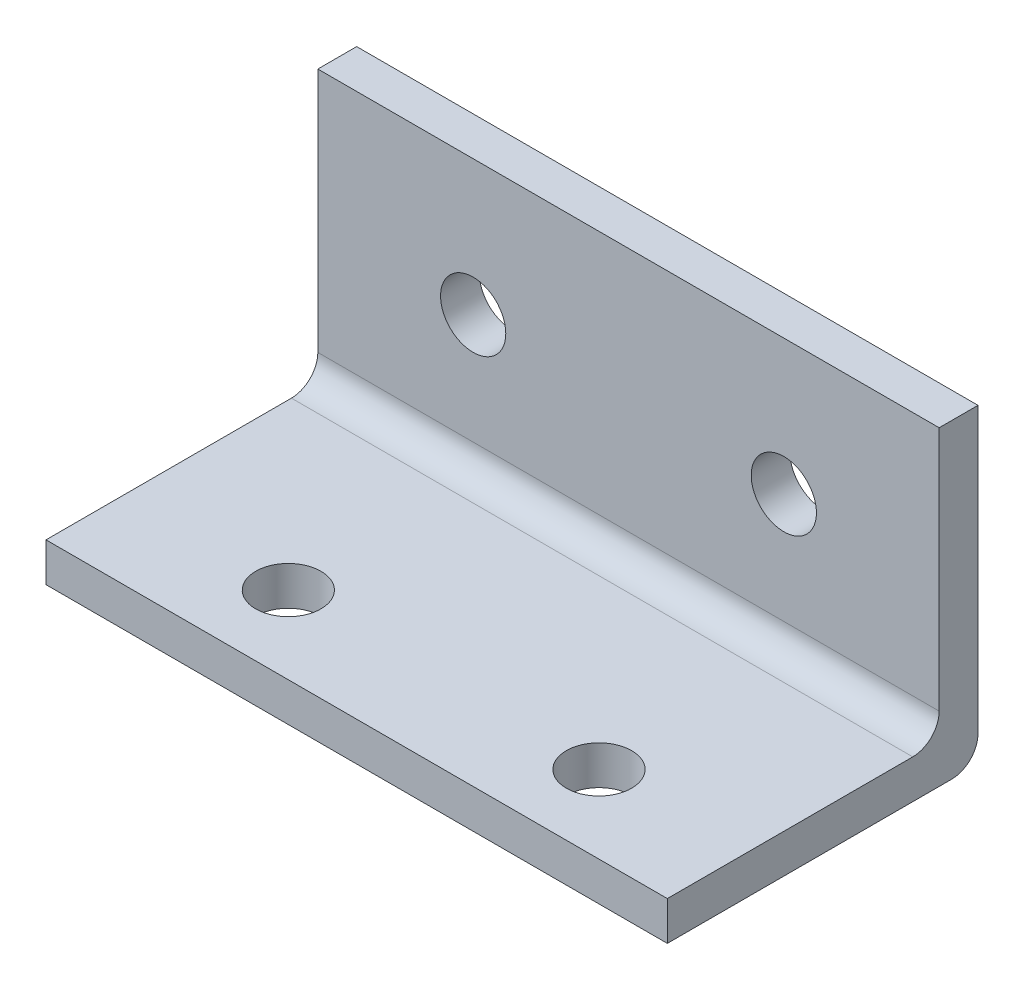
ISO-10303-21;
HEADER;
FILE_DESCRIPTION(('STEP AP214'),'2;1');
FILE_NAME('part.step','',(''),(''),'','','');
FILE_SCHEMA(('AUTOMOTIVE_DESIGN { 1 0 10303 214 1 1 1 1 }'));
ENDSEC;
DATA;
#1=APPLICATION_CONTEXT('core data for automotive mechanical design processes');
#2=APPLICATION_PROTOCOL_DEFINITION('international standard','automotive_design',2000,#1);
#3=PRODUCT_CONTEXT('',#1,'mechanical');
#4=PRODUCT('Part','Part','',(#3));
#5=PRODUCT_RELATED_PRODUCT_CATEGORY('part','',(#4));
#6=PRODUCT_DEFINITION_FORMATION('','',#4);
#7=PRODUCT_DEFINITION_CONTEXT('part definition',#1,'design');
#8=PRODUCT_DEFINITION('design','',#6,#7);
#9=PRODUCT_DEFINITION_SHAPE('','',#8);
#10=(LENGTH_UNIT() NAMED_UNIT(*) SI_UNIT(.MILLI.,.METRE.));
#11=(NAMED_UNIT(*) PLANE_ANGLE_UNIT() SI_UNIT($,.RADIAN.));
#12=(NAMED_UNIT(*) SI_UNIT($,.STERADIAN.) SOLID_ANGLE_UNIT());
#13=UNCERTAINTY_MEASURE_WITH_UNIT(LENGTH_MEASURE(1.E-05),#10,'distance_accuracy_value','');
#14=(GEOMETRIC_REPRESENTATION_CONTEXT(3) GLOBAL_UNCERTAINTY_ASSIGNED_CONTEXT((#13)) GLOBAL_UNIT_ASSIGNED_CONTEXT((#10,
#11,#12)) REPRESENTATION_CONTEXT('',''));
#15=CARTESIAN_POINT('',(0.,0.,0.));
#16=DIRECTION('',(0.,0.,1.));
#17=DIRECTION('',(1.,0.,0.));
#18=AXIS2_PLACEMENT_3D('',#15,#16,#17);
#19=CARTESIAN_POINT('',(50.8,0.,0.));
#20=DIRECTION('',(0.,1.,0.));
#21=DIRECTION('',(0.,0.,1.));
#22=AXIS2_PLACEMENT_3D('',#19,#20,#21);
#23=PLANE('',#22);
#24=CARTESIAN_POINT('',(13.462,0.,19.05));
#25=DIRECTION('',(0.,1.,0.));
#26=DIRECTION('',(0.,0.,1.));
#27=AXIS2_PLACEMENT_3D('',#24,#25,#26);
#28=CIRCLE('',#27,2.667);
#29=CARTESIAN_POINT('',(13.462,0.,21.717));
#30=VERTEX_POINT('',#29);
#31=EDGE_CURVE('E148',#30,#30,#28,.F.);
#32=ORIENTED_EDGE('',*,*,#31,.F.);
#33=EDGE_LOOP('',(#32));
#34=FACE_BOUND('',#33,.T.);
#35=CARTESIAN_POINT('',(38.862,0.,19.05));
#36=DIRECTION('',(0.,1.,0.));
#37=DIRECTION('',(0.,0.,1.));
#38=AXIS2_PLACEMENT_3D('',#35,#36,#37);
#39=CIRCLE('',#38,2.667);
#40=CARTESIAN_POINT('',(38.862,0.,21.717));
#41=VERTEX_POINT('',#40);
#42=EDGE_CURVE('E209',#41,#41,#39,.F.);
#43=ORIENTED_EDGE('',*,*,#42,.F.);
#44=EDGE_LOOP('',(#43));
#45=FACE_BOUND('',#44,.T.);
#46=DIRECTION('',(0.,0.,-1.));
#47=VECTOR('',#46,1.);
#48=CARTESIAN_POINT('',(0.,0.,0.));
#49=LINE('',#48,#47);
#50=CARTESIAN_POINT('',(0.,0.,25.4));
#51=VERTEX_POINT('',#50);
#52=CARTESIAN_POINT('',(0.,0.,2.159));
#53=VERTEX_POINT('',#52);
#54=EDGE_CURVE('E144',#51,#53,#49,.T.);
#55=ORIENTED_EDGE('',*,*,#54,.T.);
#56=DIRECTION('',(-1.,0.,0.));
#57=VECTOR('',#56,1.);
#58=CARTESIAN_POINT('',(50.8,0.,2.159));
#59=LINE('',#58,#57);
#60=CARTESIAN_POINT('',(50.8,0.,2.159));
#61=VERTEX_POINT('',#60);
#62=EDGE_CURVE('E177',#53,#61,#59,.F.);
#63=ORIENTED_EDGE('',*,*,#62,.T.);
#64=DIRECTION('',(0.,0.,-1.));
#65=VECTOR('',#64,1.);
#66=CARTESIAN_POINT('',(50.8,0.,0.));
#67=LINE('',#66,#65);
#68=CARTESIAN_POINT('',(50.8,0.,25.4));
#69=VERTEX_POINT('',#68);
#70=EDGE_CURVE('E115',#69,#61,#67,.T.);
#71=ORIENTED_EDGE('',*,*,#70,.F.);
#72=DIRECTION('',(-1.,0.,0.));
#73=VECTOR('',#72,1.);
#74=CARTESIAN_POINT('',(50.8,0.,25.4));
#75=LINE('',#74,#73);
#76=EDGE_CURVE('E143',#69,#51,#75,.T.);
#77=ORIENTED_EDGE('',*,*,#76,.T.);
#78=EDGE_LOOP('',(#55,#63,#71,#77));
#79=FACE_BOUND('',#78,.T.);
#80=ADVANCED_FACE('F38',(#34,#45,#79),#23,.F.);
#81=CARTESIAN_POINT('',(50.8,0.,0.));
#82=DIRECTION('',(0.,0.,1.));
#83=DIRECTION('',(1.,0.,0.));
#84=AXIS2_PLACEMENT_3D('',#81,#82,#83);
#85=PLANE('',#84);
#86=CARTESIAN_POINT('',(12.7,14.3509999999998,0.));
#87=DIRECTION('',(0.,0.,1.));
#88=DIRECTION('',(1.,0.,0.));
#89=AXIS2_PLACEMENT_3D('',#86,#87,#88);
#90=CIRCLE('',#89,2.667);
#91=CARTESIAN_POINT('',(15.367,14.3509999999998,0.));
#92=VERTEX_POINT('',#91);
#93=EDGE_CURVE('E218',#92,#92,#90,.F.);
#94=ORIENTED_EDGE('',*,*,#93,.F.);
#95=EDGE_LOOP('',(#94));
#96=FACE_BOUND('',#95,.T.);
#97=CARTESIAN_POINT('',(38.1,14.351,0.));
#98=DIRECTION('',(0.,0.,1.));
#99=DIRECTION('',(1.,0.,0.));
#100=AXIS2_PLACEMENT_3D('',#97,#98,#99);
#101=CIRCLE('',#100,2.667);
#102=CARTESIAN_POINT('',(40.767,14.351,0.));
#103=VERTEX_POINT('',#102);
#104=EDGE_CURVE('E225',#103,#103,#101,.F.);
#105=ORIENTED_EDGE('',*,*,#104,.F.);
#106=EDGE_LOOP('',(#105));
#107=FACE_BOUND('',#106,.T.);
#108=DIRECTION('',(0.,1.,0.));
#109=VECTOR('',#108,1.);
#110=CARTESIAN_POINT('',(50.8,0.,0.));
#111=LINE('',#110,#109);
#112=CARTESIAN_POINT('',(50.8,2.159,0.));
#113=VERTEX_POINT('',#112);
#114=CARTESIAN_POINT('',(50.8,25.4,0.));
#115=VERTEX_POINT('',#114);
#116=EDGE_CURVE('E102',#113,#115,#111,.T.);
#117=ORIENTED_EDGE('',*,*,#116,.F.);
#118=DIRECTION('',(-1.,0.,0.));
#119=VECTOR('',#118,1.);
#120=CARTESIAN_POINT('',(50.8,2.159,0.));
#121=LINE('',#120,#119);
#122=CARTESIAN_POINT('',(0.,2.159,0.));
#123=VERTEX_POINT('',#122);
#124=EDGE_CURVE('E125',#113,#123,#121,.T.);
#125=ORIENTED_EDGE('',*,*,#124,.T.);
#126=DIRECTION('',(0.,1.,0.));
#127=VECTOR('',#126,1.);
#128=CARTESIAN_POINT('',(0.,0.,0.));
#129=LINE('',#128,#127);
#130=CARTESIAN_POINT('',(0.,25.4,0.));
#131=VERTEX_POINT('',#130);
#132=EDGE_CURVE('E121',#123,#131,#129,.T.);
#133=ORIENTED_EDGE('',*,*,#132,.T.);
#134=DIRECTION('',(-1.,0.,0.));
#135=VECTOR('',#134,1.);
#136=CARTESIAN_POINT('',(50.8,25.4,0.));
#137=LINE('',#136,#135);
#138=EDGE_CURVE('E118',#115,#131,#137,.T.);
#139=ORIENTED_EDGE('',*,*,#138,.F.);
#140=EDGE_LOOP('',(#117,#125,#133,#139));
#141=FACE_BOUND('',#140,.T.);
#142=ADVANCED_FACE('F119',(#96,#107,#141),#85,.F.);
#143=CARTESIAN_POINT('',(50.8,25.4,3.175));
#144=DIRECTION('',(0.,-1.,0.));
#145=DIRECTION('',(0.,0.,-1.));
#146=AXIS2_PLACEMENT_3D('',#143,#144,#145);
#147=PLANE('',#146);
#148=DIRECTION('',(0.,0.,1.));
#149=VECTOR('',#148,1.);
#150=CARTESIAN_POINT('',(0.,25.4,3.175));
#151=LINE('',#150,#149);
#152=CARTESIAN_POINT('',(0.,25.4,3.175));
#153=VERTEX_POINT('',#152);
#154=EDGE_CURVE('E151',#131,#153,#151,.T.);
#155=ORIENTED_EDGE('',*,*,#154,.T.);
#156=DIRECTION('',(-1.,0.,0.));
#157=VECTOR('',#156,1.);
#158=CARTESIAN_POINT('',(50.8,25.4,3.175));
#159=LINE('',#158,#157);
#160=CARTESIAN_POINT('',(50.8,25.4,3.175));
#161=VERTEX_POINT('',#160);
#162=EDGE_CURVE('E126',#161,#153,#159,.T.);
#163=ORIENTED_EDGE('',*,*,#162,.F.);
#164=DIRECTION('',(0.,0.,1.));
#165=VECTOR('',#164,1.);
#166=CARTESIAN_POINT('',(50.8,25.4,3.175));
#167=LINE('',#166,#165);
#168=EDGE_CURVE('E107',#115,#161,#167,.T.);
#169=ORIENTED_EDGE('',*,*,#168,.F.);
#170=ORIENTED_EDGE('',*,*,#138,.T.);
#171=EDGE_LOOP('',(#155,#163,#169,#170));
#172=FACE_BOUND('',#171,.T.);
#173=ADVANCED_FACE('F128',(#172),#147,.F.);
#174=CARTESIAN_POINT('',(50.8,3.175,3.175));
#175=DIRECTION('',(0.,0.,-1.));
#176=DIRECTION('',(-1.,0.,0.));
#177=AXIS2_PLACEMENT_3D('',#174,#175,#176);
#178=PLANE('',#177);
#179=CARTESIAN_POINT('',(12.7,14.3509999999998,3.175));
#180=DIRECTION('',(0.,0.,1.));
#181=DIRECTION('',(1.,0.,0.));
#182=AXIS2_PLACEMENT_3D('',#179,#180,#181);
#183=CIRCLE('',#182,2.667);
#184=CARTESIAN_POINT('',(15.367,14.3509999999998,3.175));
#185=VERTEX_POINT('',#184);
#186=EDGE_CURVE('E229',#185,#185,#183,.T.);
#187=ORIENTED_EDGE('',*,*,#186,.F.);
#188=EDGE_LOOP('',(#187));
#189=FACE_BOUND('',#188,.T.);
#190=CARTESIAN_POINT('',(38.1,14.351,3.175));
#191=DIRECTION('',(0.,0.,1.));
#192=DIRECTION('',(1.,0.,0.));
#193=AXIS2_PLACEMENT_3D('',#190,#191,#192);
#194=CIRCLE('',#193,2.667);
#195=CARTESIAN_POINT('',(40.767,14.351,3.175));
#196=VERTEX_POINT('',#195);
#197=EDGE_CURVE('E230',#196,#196,#194,.T.);
#198=ORIENTED_EDGE('',*,*,#197,.F.);
#199=EDGE_LOOP('',(#198));
#200=FACE_BOUND('',#199,.T.);
#201=DIRECTION('',(0.,-1.,0.));
#202=VECTOR('',#201,1.);
#203=CARTESIAN_POINT('',(0.,3.175,3.175));
#204=LINE('',#203,#202);
#205=CARTESIAN_POINT('',(0.,5.334,3.175));
#206=VERTEX_POINT('',#205);
#207=EDGE_CURVE('E154',#153,#206,#204,.T.);
#208=ORIENTED_EDGE('',*,*,#207,.T.);
#209=DIRECTION('',(-1.,0.,0.));
#210=VECTOR('',#209,1.);
#211=CARTESIAN_POINT('',(50.8,5.334,3.175));
#212=LINE('',#211,#210);
#213=CARTESIAN_POINT('',(50.8,5.334,3.175));
#214=VERTEX_POINT('',#213);
#215=EDGE_CURVE('E60',#206,#214,#212,.F.);
#216=ORIENTED_EDGE('',*,*,#215,.T.);
#217=DIRECTION('',(0.,-1.,0.));
#218=VECTOR('',#217,1.);
#219=CARTESIAN_POINT('',(50.8,3.175,3.175));
#220=LINE('',#219,#218);
#221=EDGE_CURVE('E131',#161,#214,#220,.T.);
#222=ORIENTED_EDGE('',*,*,#221,.F.);
#223=ORIENTED_EDGE('',*,*,#162,.T.);
#224=EDGE_LOOP('',(#208,#216,#222,#223));
#225=FACE_BOUND('',#224,.T.);
#226=ADVANCED_FACE('F195',(#189,#200,#225),#178,.F.);
#227=CARTESIAN_POINT('',(50.8,3.175,25.4));
#228=DIRECTION('',(0.,-1.,0.));
#229=DIRECTION('',(0.,0.,-1.));
#230=AXIS2_PLACEMENT_3D('',#227,#228,#229);
#231=PLANE('',#230);
#232=CARTESIAN_POINT('',(13.462,3.175,19.05));
#233=DIRECTION('',(0.,1.,0.));
#234=DIRECTION('',(0.,0.,1.));
#235=AXIS2_PLACEMENT_3D('',#232,#233,#234);
#236=CIRCLE('',#235,2.667);
#237=CARTESIAN_POINT('',(13.462,3.175,21.717));
#238=VERTEX_POINT('',#237);
#239=EDGE_CURVE('E213',#238,#238,#236,.T.);
#240=ORIENTED_EDGE('',*,*,#239,.F.);
#241=EDGE_LOOP('',(#240));
#242=FACE_BOUND('',#241,.T.);
#243=CARTESIAN_POINT('',(38.862,3.175,19.05));
#244=DIRECTION('',(0.,1.,0.));
#245=DIRECTION('',(0.,0.,1.));
#246=AXIS2_PLACEMENT_3D('',#243,#244,#245);
#247=CIRCLE('',#246,2.667);
#248=CARTESIAN_POINT('',(38.862,3.175,21.717));
#249=VERTEX_POINT('',#248);
#250=EDGE_CURVE('E214',#249,#249,#247,.T.);
#251=ORIENTED_EDGE('',*,*,#250,.F.);
#252=EDGE_LOOP('',(#251));
#253=FACE_BOUND('',#252,.T.);
#254=DIRECTION('',(0.,0.,1.));
#255=VECTOR('',#254,1.);
#256=CARTESIAN_POINT('',(50.8,3.175,25.4));
#257=LINE('',#256,#255);
#258=CARTESIAN_POINT('',(50.8,3.175,5.334));
#259=VERTEX_POINT('',#258);
#260=CARTESIAN_POINT('',(50.8,3.175,25.4));
#261=VERTEX_POINT('',#260);
#262=EDGE_CURVE('E134',#259,#261,#257,.T.);
#263=ORIENTED_EDGE('',*,*,#262,.F.);
#264=DIRECTION('',(-1.,0.,0.));
#265=VECTOR('',#264,1.);
#266=CARTESIAN_POINT('',(0.,3.175,5.334));
#267=LINE('',#266,#265);
#268=CARTESIAN_POINT('',(0.,3.175,5.334));
#269=VERTEX_POINT('',#268);
#270=EDGE_CURVE('E182',#259,#269,#267,.T.);
#271=ORIENTED_EDGE('',*,*,#270,.T.);
#272=DIRECTION('',(0.,0.,1.));
#273=VECTOR('',#272,1.);
#274=CARTESIAN_POINT('',(0.,3.175,25.4));
#275=LINE('',#274,#273);
#276=CARTESIAN_POINT('',(0.,3.175,25.4));
#277=VERTEX_POINT('',#276);
#278=EDGE_CURVE('E157',#269,#277,#275,.T.);
#279=ORIENTED_EDGE('',*,*,#278,.T.);
#280=DIRECTION('',(-1.,0.,0.));
#281=VECTOR('',#280,1.);
#282=CARTESIAN_POINT('',(50.8,3.175,25.4));
#283=LINE('',#282,#281);
#284=EDGE_CURVE('E166',#261,#277,#283,.T.);
#285=ORIENTED_EDGE('',*,*,#284,.F.);
#286=EDGE_LOOP('',(#263,#271,#279,#285));
#287=FACE_BOUND('',#286,.T.);
#288=ADVANCED_FACE('F197',(#242,#253,#287),#231,.F.);
#289=CARTESIAN_POINT('',(50.8,0.,25.4));
#290=DIRECTION('',(0.,0.,-1.));
#291=DIRECTION('',(-1.,0.,0.));
#292=AXIS2_PLACEMENT_3D('',#289,#290,#291);
#293=PLANE('',#292);
#294=DIRECTION('',(0.,-1.,0.));
#295=VECTOR('',#294,1.);
#296=CARTESIAN_POINT('',(0.,0.,25.4));
#297=LINE('',#296,#295);
#298=EDGE_CURVE('E160',#277,#51,#297,.T.);
#299=ORIENTED_EDGE('',*,*,#298,.T.);
#300=ORIENTED_EDGE('',*,*,#76,.F.);
#301=DIRECTION('',(0.,-1.,0.));
#302=VECTOR('',#301,1.);
#303=CARTESIAN_POINT('',(50.8,0.,25.4));
#304=LINE('',#303,#302);
#305=EDGE_CURVE('E140',#261,#69,#304,.T.);
#306=ORIENTED_EDGE('',*,*,#305,.F.);
#307=ORIENTED_EDGE('',*,*,#284,.T.);
#308=EDGE_LOOP('',(#299,#300,#306,#307));
#309=FACE_BOUND('',#308,.T.);
#310=ADVANCED_FACE('F203',(#309),#293,.F.);
#311=CARTESIAN_POINT('',(50.8,0.,0.));
#312=DIRECTION('',(-1.,0.,0.));
#313=DIRECTION('',(0.,0.,1.));
#314=AXIS2_PLACEMENT_3D('',#311,#312,#313);
#315=PLANE('',#314);
#316=ORIENTED_EDGE('',*,*,#70,.T.);
#317=CARTESIAN_POINT('',(50.8,2.159,2.159));
#318=DIRECTION('',(-1.,0.,0.));
#319=DIRECTION('',(0.,0.,1.));
#320=AXIS2_PLACEMENT_3D('',#317,#318,#319);
#321=CIRCLE('',#320,2.159);
#322=EDGE_CURVE('E110',#61,#113,#321,.F.);
#323=ORIENTED_EDGE('',*,*,#322,.T.);
#324=ORIENTED_EDGE('',*,*,#116,.T.);
#325=ORIENTED_EDGE('',*,*,#168,.T.);
#326=ORIENTED_EDGE('',*,*,#221,.T.);
#327=CARTESIAN_POINT('',(50.8,5.334,5.334));
#328=DIRECTION('',(-1.,0.,0.));
#329=DIRECTION('',(0.,0.,1.));
#330=AXIS2_PLACEMENT_3D('',#327,#328,#329);
#331=CIRCLE('',#330,2.159);
#332=EDGE_CURVE('E11',#214,#259,#331,.T.);
#333=ORIENTED_EDGE('',*,*,#332,.T.);
#334=ORIENTED_EDGE('',*,*,#262,.T.);
#335=ORIENTED_EDGE('',*,*,#305,.T.);
#336=EDGE_LOOP('',(#316,#323,#324,#325,#326,#333,#334,#335));
#337=FACE_BOUND('',#336,.T.);
#338=ADVANCED_FACE('F105',(#337),#315,.F.);
#339=CARTESIAN_POINT('',(0.,0.,0.));
#340=DIRECTION('',(-1.,0.,0.));
#341=DIRECTION('',(0.,0.,1.));
#342=AXIS2_PLACEMENT_3D('',#339,#340,#341);
#343=PLANE('',#342);
#344=ORIENTED_EDGE('',*,*,#132,.F.);
#345=CARTESIAN_POINT('',(0.,2.159,2.159));
#346=DIRECTION('',(-1.,0.,0.));
#347=DIRECTION('',(0.,0.,1.));
#348=AXIS2_PLACEMENT_3D('',#345,#346,#347);
#349=CIRCLE('',#348,2.159);
#350=EDGE_CURVE('E174',#123,#53,#349,.T.);
#351=ORIENTED_EDGE('',*,*,#350,.T.);
#352=ORIENTED_EDGE('',*,*,#54,.F.);
#353=ORIENTED_EDGE('',*,*,#298,.F.);
#354=ORIENTED_EDGE('',*,*,#278,.F.);
#355=CARTESIAN_POINT('',(0.,5.334,5.334));
#356=DIRECTION('',(-1.,0.,0.));
#357=DIRECTION('',(0.,0.,1.));
#358=AXIS2_PLACEMENT_3D('',#355,#356,#357);
#359=CIRCLE('',#358,2.159);
#360=EDGE_CURVE('E47',#269,#206,#359,.F.);
#361=ORIENTED_EDGE('',*,*,#360,.T.);
#362=ORIENTED_EDGE('',*,*,#207,.F.);
#363=ORIENTED_EDGE('',*,*,#154,.F.);
#364=EDGE_LOOP('',(#344,#351,#352,#353,#354,#361,#362,#363));
#365=FACE_BOUND('',#364,.T.);
#366=ADVANCED_FACE('F191',(#365),#343,.T.);
#367=CARTESIAN_POINT('',(38.862,-7.5434151416981,19.05));
#368=DIRECTION('',(0.,1.,0.));
#369=DIRECTION('',(0.,0.,1.));
#370=AXIS2_PLACEMENT_3D('',#367,#368,#369);
#371=CYLINDRICAL_SURFACE('',#370,2.667);
#372=ORIENTED_EDGE('',*,*,#42,.T.);
#373=EDGE_LOOP('',(#372));
#374=FACE_BOUND('',#373,.T.);
#375=ORIENTED_EDGE('',*,*,#250,.T.);
#376=EDGE_LOOP('',(#375));
#377=FACE_BOUND('',#376,.T.);
#378=ADVANCED_FACE('F260',(#374,#377),#371,.F.);
#379=CARTESIAN_POINT('',(13.462,-7.5434151416981,19.05));
#380=DIRECTION('',(0.,1.,0.));
#381=DIRECTION('',(0.,0.,1.));
#382=AXIS2_PLACEMENT_3D('',#379,#380,#381);
#383=CYLINDRICAL_SURFACE('',#382,2.667);
#384=ORIENTED_EDGE('',*,*,#31,.T.);
#385=EDGE_LOOP('',(#384));
#386=FACE_BOUND('',#385,.T.);
#387=ORIENTED_EDGE('',*,*,#239,.T.);
#388=EDGE_LOOP('',(#387));
#389=FACE_BOUND('',#388,.T.);
#390=ADVANCED_FACE('F250',(#386,#389),#383,.F.);
#391=CARTESIAN_POINT('',(38.1,14.351,-7.5434151416981));
#392=DIRECTION('',(0.,0.,1.));
#393=DIRECTION('',(1.,0.,0.));
#394=AXIS2_PLACEMENT_3D('',#391,#392,#393);
#395=CYLINDRICAL_SURFACE('',#394,2.667);
#396=ORIENTED_EDGE('',*,*,#104,.T.);
#397=EDGE_LOOP('',(#396));
#398=FACE_BOUND('',#397,.T.);
#399=ORIENTED_EDGE('',*,*,#197,.T.);
#400=EDGE_LOOP('',(#399));
#401=FACE_BOUND('',#400,.T.);
#402=ADVANCED_FACE('F248',(#398,#401),#395,.F.);
#403=CARTESIAN_POINT('',(12.7,14.3509999999998,-7.5434151416981));
#404=DIRECTION('',(0.,0.,1.));
#405=DIRECTION('',(1.,0.,0.));
#406=AXIS2_PLACEMENT_3D('',#403,#404,#405);
#407=CYLINDRICAL_SURFACE('',#406,2.667);
#408=ORIENTED_EDGE('',*,*,#93,.T.);
#409=EDGE_LOOP('',(#408));
#410=FACE_BOUND('',#409,.T.);
#411=ORIENTED_EDGE('',*,*,#186,.T.);
#412=EDGE_LOOP('',(#411));
#413=FACE_BOUND('',#412,.T.);
#414=ADVANCED_FACE('F241',(#410,#413),#407,.F.);
#415=CARTESIAN_POINT('',(50.8,2.159,2.159));
#416=DIRECTION('',(-1.,0.,0.));
#417=DIRECTION('',(0.,0.,1.));
#418=AXIS2_PLACEMENT_3D('',#415,#416,#417);
#419=CYLINDRICAL_SURFACE('',#418,2.159);
#420=ORIENTED_EDGE('',*,*,#322,.F.);
#421=ORIENTED_EDGE('',*,*,#62,.F.);
#422=ORIENTED_EDGE('',*,*,#350,.F.);
#423=ORIENTED_EDGE('',*,*,#124,.F.);
#424=EDGE_LOOP('',(#420,#421,#422,#423));
#425=FACE_BOUND('',#424,.T.);
#426=ADVANCED_FACE('F257',(#425),#419,.T.);
#427=CARTESIAN_POINT('',(50.8,5.334,5.334));
#428=DIRECTION('',(1.,0.,0.));
#429=DIRECTION('',(0.,0.,-1.));
#430=AXIS2_PLACEMENT_3D('',#427,#428,#429);
#431=CYLINDRICAL_SURFACE('',#430,2.159);
#432=ORIENTED_EDGE('',*,*,#332,.F.);
#433=ORIENTED_EDGE('',*,*,#215,.F.);
#434=ORIENTED_EDGE('',*,*,#360,.F.);
#435=ORIENTED_EDGE('',*,*,#270,.F.);
#436=EDGE_LOOP('',(#432,#433,#434,#435));
#437=FACE_BOUND('',#436,.T.);
#438=ADVANCED_FACE('F40',(#437),#431,.F.);
#439=CLOSED_SHELL('',(#80,#142,#173,#226,#288,#310,#338,#366,#378,#390,#402,#414,#426,#438));
#440=MANIFOLD_SOLID_BREP('B2',#439);
#441=ADVANCED_BREP_SHAPE_REPRESENTATION('',(#18,#440),#14);
#442=SHAPE_DEFINITION_REPRESENTATION(#9,#441);
ENDSEC;
END-ISO-10303-21;
